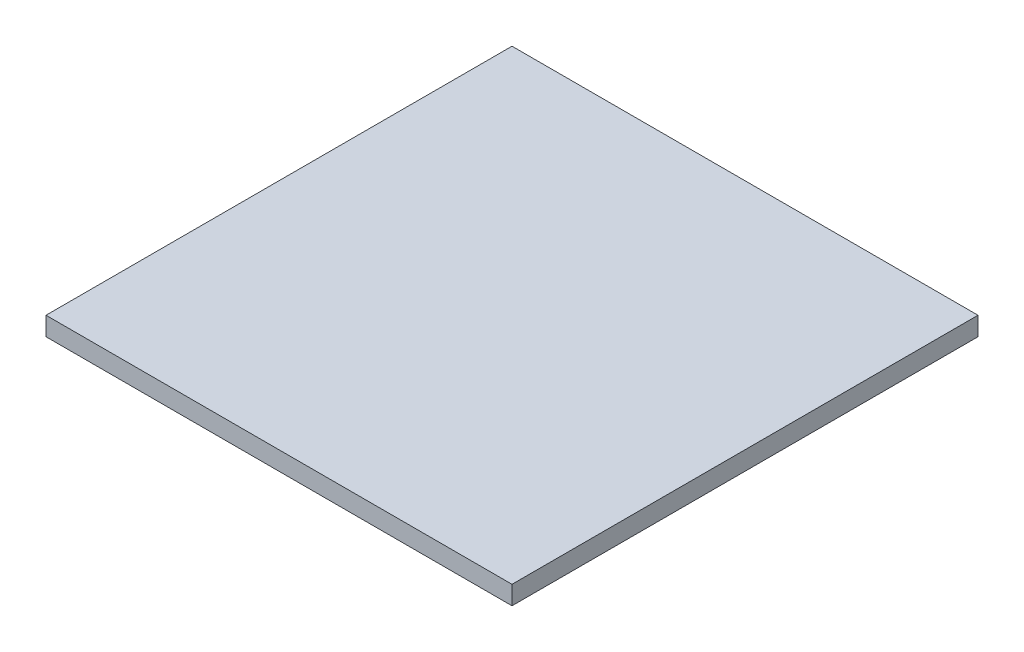
ISO-10303-21;
HEADER;
FILE_DESCRIPTION(('STEP AP214'),'2;1');
FILE_NAME('part.step','',(''),(''),'','','');
FILE_SCHEMA(('AUTOMOTIVE_DESIGN { 1 0 10303 214 1 1 1 1 }'));
ENDSEC;
DATA;
#1=APPLICATION_CONTEXT('core data for automotive mechanical design processes');
#2=APPLICATION_PROTOCOL_DEFINITION('international standard','automotive_design',2000,#1);
#3=PRODUCT_CONTEXT('',#1,'mechanical');
#4=PRODUCT('Part','Part','',(#3));
#5=PRODUCT_RELATED_PRODUCT_CATEGORY('part','',(#4));
#6=PRODUCT_DEFINITION_FORMATION('','',#4);
#7=PRODUCT_DEFINITION_CONTEXT('part definition',#1,'design');
#8=PRODUCT_DEFINITION('design','',#6,#7);
#9=PRODUCT_DEFINITION_SHAPE('','',#8);
#10=(LENGTH_UNIT() NAMED_UNIT(*) SI_UNIT(.MILLI.,.METRE.));
#11=(NAMED_UNIT(*) PLANE_ANGLE_UNIT() SI_UNIT($,.RADIAN.));
#12=(NAMED_UNIT(*) SI_UNIT($,.STERADIAN.) SOLID_ANGLE_UNIT());
#13=UNCERTAINTY_MEASURE_WITH_UNIT(LENGTH_MEASURE(1.E-05),#10,'distance_accuracy_value','');
#14=(GEOMETRIC_REPRESENTATION_CONTEXT(3) GLOBAL_UNCERTAINTY_ASSIGNED_CONTEXT((#13)) GLOBAL_UNIT_ASSIGNED_CONTEXT((#10,
#11,#12)) REPRESENTATION_CONTEXT('',''));
#15=CARTESIAN_POINT('',(0.,0.,0.));
#16=DIRECTION('',(0.,0.,1.));
#17=DIRECTION('',(1.,0.,0.));
#18=AXIS2_PLACEMENT_3D('',#15,#16,#17);
#19=CARTESIAN_POINT('',(25.,2.,-25.));
#20=DIRECTION('',(-1.,0.,0.));
#21=DIRECTION('',(0.,0.,1.));
#22=AXIS2_PLACEMENT_3D('',#19,#20,#21);
#23=PLANE('',#22);
#24=DIRECTION('',(0.,0.,-1.));
#25=VECTOR('',#24,1.);
#26=CARTESIAN_POINT('',(25.,0.,-25.));
#27=LINE('',#26,#25);
#28=CARTESIAN_POINT('',(25.,0.,25.));
#29=VERTEX_POINT('',#28);
#30=CARTESIAN_POINT('',(25.,0.,-25.));
#31=VERTEX_POINT('',#30);
#32=EDGE_CURVE('E98',#29,#31,#27,.T.);
#33=ORIENTED_EDGE('',*,*,#32,.T.);
#34=DIRECTION('',(0.,-1.,0.));
#35=VECTOR('',#34,1.);
#36=CARTESIAN_POINT('',(25.,2.,-25.));
#37=LINE('',#36,#35);
#38=CARTESIAN_POINT('',(25.,2.,-25.));
#39=VERTEX_POINT('',#38);
#40=EDGE_CURVE('E11',#39,#31,#37,.T.);
#41=ORIENTED_EDGE('',*,*,#40,.F.);
#42=DIRECTION('',(0.,0.,-1.));
#43=VECTOR('',#42,1.);
#44=CARTESIAN_POINT('',(25.,2.,-25.));
#45=LINE('',#44,#43);
#46=CARTESIAN_POINT('',(25.,2.,25.));
#47=VERTEX_POINT('',#46);
#48=EDGE_CURVE('E86',#47,#39,#45,.T.);
#49=ORIENTED_EDGE('',*,*,#48,.F.);
#50=DIRECTION('',(0.,-1.,0.));
#51=VECTOR('',#50,1.);
#52=CARTESIAN_POINT('',(25.,2.,25.));
#53=LINE('',#52,#51);
#54=EDGE_CURVE('E94',#47,#29,#53,.T.);
#55=ORIENTED_EDGE('',*,*,#54,.T.);
#56=EDGE_LOOP('',(#33,#41,#49,#55));
#57=FACE_BOUND('',#56,.T.);
#58=ADVANCED_FACE('F35',(#57),#23,.F.);
#59=CARTESIAN_POINT('',(-25.,2.,-25.));
#60=DIRECTION('',(0.,0.,1.));
#61=DIRECTION('',(1.,0.,0.));
#62=AXIS2_PLACEMENT_3D('',#59,#60,#61);
#63=PLANE('',#62);
#64=DIRECTION('',(-1.,0.,0.));
#65=VECTOR('',#64,1.);
#66=CARTESIAN_POINT('',(-25.,0.,-25.));
#67=LINE('',#66,#65);
#68=CARTESIAN_POINT('',(-25.,0.,-25.));
#69=VERTEX_POINT('',#68);
#70=EDGE_CURVE('E90',#31,#69,#67,.T.);
#71=ORIENTED_EDGE('',*,*,#70,.T.);
#72=DIRECTION('',(0.,-1.,0.));
#73=VECTOR('',#72,1.);
#74=CARTESIAN_POINT('',(-25.,2.,-25.));
#75=LINE('',#74,#73);
#76=CARTESIAN_POINT('',(-25.,2.,-25.));
#77=VERTEX_POINT('',#76);
#78=EDGE_CURVE('E43',#77,#69,#75,.T.);
#79=ORIENTED_EDGE('',*,*,#78,.F.);
#80=DIRECTION('',(-1.,0.,0.));
#81=VECTOR('',#80,1.);
#82=CARTESIAN_POINT('',(-25.,2.,-25.));
#83=LINE('',#82,#81);
#84=EDGE_CURVE('E81',#39,#77,#83,.T.);
#85=ORIENTED_EDGE('',*,*,#84,.F.);
#86=ORIENTED_EDGE('',*,*,#40,.T.);
#87=EDGE_LOOP('',(#71,#79,#85,#86));
#88=FACE_BOUND('',#87,.T.);
#89=ADVANCED_FACE('F89',(#88),#63,.F.);
#90=CARTESIAN_POINT('',(-25.,2.,-25.));
#91=DIRECTION('',(1.,0.,0.));
#92=DIRECTION('',(0.,0.,-1.));
#93=AXIS2_PLACEMENT_3D('',#90,#91,#92);
#94=PLANE('',#93);
#95=DIRECTION('',(0.,0.,1.));
#96=VECTOR('',#95,1.);
#97=CARTESIAN_POINT('',(-25.,0.,-25.));
#98=LINE('',#97,#96);
#99=CARTESIAN_POINT('',(-25.,0.,25.));
#100=VERTEX_POINT('',#99);
#101=EDGE_CURVE('E68',#69,#100,#98,.T.);
#102=ORIENTED_EDGE('',*,*,#101,.T.);
#103=DIRECTION('',(0.,-1.,0.));
#104=VECTOR('',#103,1.);
#105=CARTESIAN_POINT('',(-25.,2.,25.));
#106=LINE('',#105,#104);
#107=CARTESIAN_POINT('',(-25.,2.,25.));
#108=VERTEX_POINT('',#107);
#109=EDGE_CURVE('E91',#108,#100,#106,.T.);
#110=ORIENTED_EDGE('',*,*,#109,.F.);
#111=DIRECTION('',(0.,0.,1.));
#112=VECTOR('',#111,1.);
#113=CARTESIAN_POINT('',(-25.,2.,-25.));
#114=LINE('',#113,#112);
#115=EDGE_CURVE('E84',#77,#108,#114,.T.);
#116=ORIENTED_EDGE('',*,*,#115,.F.);
#117=ORIENTED_EDGE('',*,*,#78,.T.);
#118=EDGE_LOOP('',(#102,#110,#116,#117));
#119=FACE_BOUND('',#118,.T.);
#120=ADVANCED_FACE('F92',(#119),#94,.F.);
#121=CARTESIAN_POINT('',(-25.,2.,25.));
#122=DIRECTION('',(0.,0.,-1.));
#123=DIRECTION('',(-1.,0.,0.));
#124=AXIS2_PLACEMENT_3D('',#121,#122,#123);
#125=PLANE('',#124);
#126=DIRECTION('',(1.,0.,0.));
#127=VECTOR('',#126,1.);
#128=CARTESIAN_POINT('',(-25.,0.,25.));
#129=LINE('',#128,#127);
#130=EDGE_CURVE('E74',#100,#29,#129,.T.);
#131=ORIENTED_EDGE('',*,*,#130,.T.);
#132=ORIENTED_EDGE('',*,*,#54,.F.);
#133=DIRECTION('',(1.,0.,0.));
#134=VECTOR('',#133,1.);
#135=CARTESIAN_POINT('',(-25.,2.,25.));
#136=LINE('',#135,#134);
#137=EDGE_CURVE('E51',#108,#47,#136,.T.);
#138=ORIENTED_EDGE('',*,*,#137,.F.);
#139=ORIENTED_EDGE('',*,*,#109,.T.);
#140=EDGE_LOOP('',(#131,#132,#138,#139));
#141=FACE_BOUND('',#140,.T.);
#142=ADVANCED_FACE('F105',(#141),#125,.F.);
#143=CARTESIAN_POINT('',(0.,2.,0.));
#144=DIRECTION('',(0.,1.,0.));
#145=DIRECTION('',(0.,0.,1.));
#146=AXIS2_PLACEMENT_3D('',#143,#144,#145);
#147=PLANE('',#146);
#148=ORIENTED_EDGE('',*,*,#48,.T.);
#149=ORIENTED_EDGE('',*,*,#84,.T.);
#150=ORIENTED_EDGE('',*,*,#115,.T.);
#151=ORIENTED_EDGE('',*,*,#137,.T.);
#152=EDGE_LOOP('',(#148,#149,#150,#151));
#153=FACE_BOUND('',#152,.T.);
#154=ADVANCED_FACE('F82',(#153),#147,.T.);
#155=CARTESIAN_POINT('',(0.,0.,0.));
#156=DIRECTION('',(0.,1.,0.));
#157=DIRECTION('',(0.,0.,1.));
#158=AXIS2_PLACEMENT_3D('',#155,#156,#157);
#159=PLANE('',#158);
#160=ORIENTED_EDGE('',*,*,#32,.F.);
#161=ORIENTED_EDGE('',*,*,#130,.F.);
#162=ORIENTED_EDGE('',*,*,#101,.F.);
#163=ORIENTED_EDGE('',*,*,#70,.F.);
#164=EDGE_LOOP('',(#160,#161,#162,#163));
#165=FACE_BOUND('',#164,.T.);
#166=ADVANCED_FACE('F108',(#165),#159,.F.);
#167=CLOSED_SHELL('',(#58,#89,#120,#142,#154,#166));
#168=MANIFOLD_SOLID_BREP('B2',#167);
#169=ADVANCED_BREP_SHAPE_REPRESENTATION('',(#18,#168),#14);
#170=SHAPE_DEFINITION_REPRESENTATION(#9,#169);
ENDSEC;
END-ISO-10303-21;
